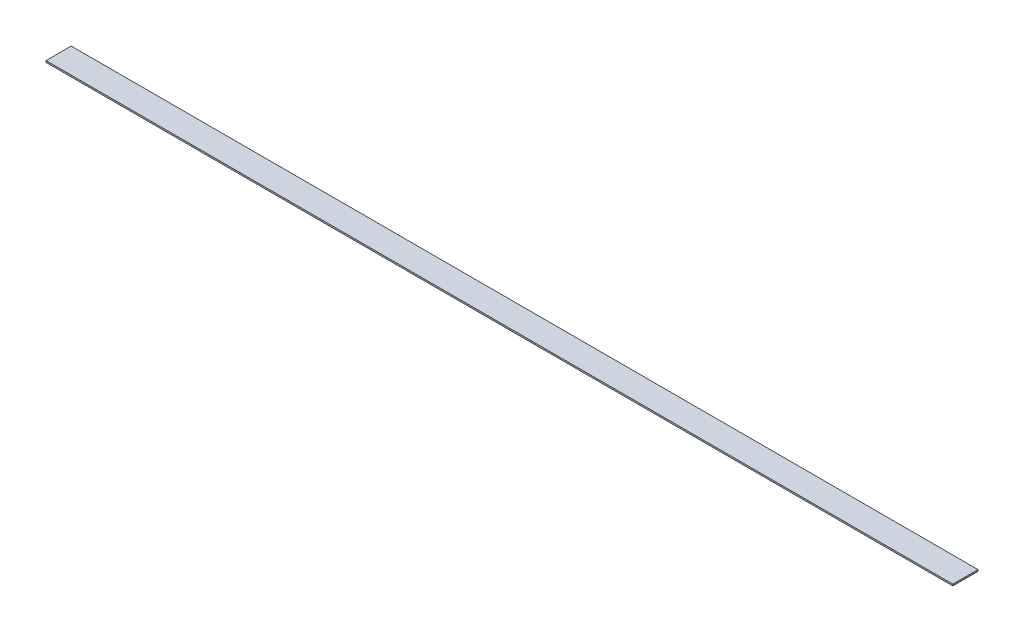
ISO-10303-21;
HEADER;
FILE_DESCRIPTION(('STEP AP214'),'2;1');
FILE_NAME('part.step','',(''),(''),'','','');
FILE_SCHEMA(('AUTOMOTIVE_DESIGN { 1 0 10303 214 1 1 1 1 }'));
ENDSEC;
DATA;
#1=APPLICATION_CONTEXT('core data for automotive mechanical design processes');
#2=APPLICATION_PROTOCOL_DEFINITION('international standard','automotive_design',2000,#1);
#3=PRODUCT_CONTEXT('',#1,'mechanical');
#4=PRODUCT('Part','Part','',(#3));
#5=PRODUCT_RELATED_PRODUCT_CATEGORY('part','',(#4));
#6=PRODUCT_DEFINITION_FORMATION('','',#4);
#7=PRODUCT_DEFINITION_CONTEXT('part definition',#1,'design');
#8=PRODUCT_DEFINITION('design','',#6,#7);
#9=PRODUCT_DEFINITION_SHAPE('','',#8);
#10=(LENGTH_UNIT() NAMED_UNIT(*) SI_UNIT(.MILLI.,.METRE.));
#11=(NAMED_UNIT(*) PLANE_ANGLE_UNIT() SI_UNIT($,.RADIAN.));
#12=(NAMED_UNIT(*) SI_UNIT($,.STERADIAN.) SOLID_ANGLE_UNIT());
#13=UNCERTAINTY_MEASURE_WITH_UNIT(LENGTH_MEASURE(1.E-05),#10,'distance_accuracy_value','');
#14=(GEOMETRIC_REPRESENTATION_CONTEXT(3) GLOBAL_UNCERTAINTY_ASSIGNED_CONTEXT((#13)) GLOBAL_UNIT_ASSIGNED_CONTEXT((#10,
#11,#12)) REPRESENTATION_CONTEXT('',''));
#15=CARTESIAN_POINT('',(0.,0.,0.));
#16=DIRECTION('',(0.,0.,1.));
#17=DIRECTION('',(1.,0.,0.));
#18=AXIS2_PLACEMENT_3D('',#15,#16,#17);
#19=CARTESIAN_POINT('',(0.,1.5875,0.));
#20=DIRECTION('',(1.,0.,0.));
#21=DIRECTION('',(0.,0.,-1.));
#22=AXIS2_PLACEMENT_3D('',#19,#20,#21);
#23=PLANE('',#22);
#24=DIRECTION('',(0.,0.,1.));
#25=VECTOR('',#24,1.);
#26=CARTESIAN_POINT('',(0.,0.,0.));
#27=LINE('',#26,#25);
#28=CARTESIAN_POINT('',(0.,0.,-25.4));
#29=VERTEX_POINT('',#28);
#30=CARTESIAN_POINT('',(0.,0.,0.));
#31=VERTEX_POINT('',#30);
#32=EDGE_CURVE('E115',#29,#31,#27,.T.);
#33=ORIENTED_EDGE('',*,*,#32,.T.);
#34=DIRECTION('',(0.,-1.,0.));
#35=VECTOR('',#34,1.);
#36=CARTESIAN_POINT('',(0.,1.5875,0.));
#37=LINE('',#36,#35);
#38=CARTESIAN_POINT('',(0.,1.5875,0.));
#39=VERTEX_POINT('',#38);
#40=EDGE_CURVE('E11',#39,#31,#37,.T.);
#41=ORIENTED_EDGE('',*,*,#40,.F.);
#42=DIRECTION('',(0.,0.,1.));
#43=VECTOR('',#42,1.);
#44=CARTESIAN_POINT('',(0.,1.5875,0.));
#45=LINE('',#44,#43);
#46=CARTESIAN_POINT('',(0.,1.5875,-25.4));
#47=VERTEX_POINT('',#46);
#48=EDGE_CURVE('E98',#47,#39,#45,.T.);
#49=ORIENTED_EDGE('',*,*,#48,.F.);
#50=DIRECTION('',(0.,-1.,0.));
#51=VECTOR('',#50,1.);
#52=CARTESIAN_POINT('',(0.,1.5875,-25.4));
#53=LINE('',#52,#51);
#54=EDGE_CURVE('E111',#47,#29,#53,.T.);
#55=ORIENTED_EDGE('',*,*,#54,.T.);
#56=EDGE_LOOP('',(#33,#41,#49,#55));
#57=FACE_BOUND('',#56,.T.);
#58=ADVANCED_FACE('F38',(#57),#23,.F.);
#59=CARTESIAN_POINT('',(0.,1.5875,0.));
#60=DIRECTION('',(0.,0.,-1.));
#61=DIRECTION('',(-1.,0.,0.));
#62=AXIS2_PLACEMENT_3D('',#59,#60,#61);
#63=PLANE('',#62);
#64=DIRECTION('',(1.,0.,0.));
#65=VECTOR('',#64,1.);
#66=CARTESIAN_POINT('',(0.,0.,0.));
#67=LINE('',#66,#65);
#68=CARTESIAN_POINT('',(914.4,0.,0.));
#69=VERTEX_POINT('',#68);
#70=EDGE_CURVE('E103',#31,#69,#67,.T.);
#71=ORIENTED_EDGE('',*,*,#70,.T.);
#72=DIRECTION('',(0.,-1.,0.));
#73=VECTOR('',#72,1.);
#74=CARTESIAN_POINT('',(914.4,1.5875,0.));
#75=LINE('',#74,#73);
#76=CARTESIAN_POINT('',(914.4,1.5875,0.));
#77=VERTEX_POINT('',#76);
#78=EDGE_CURVE('E47',#77,#69,#75,.T.);
#79=ORIENTED_EDGE('',*,*,#78,.F.);
#80=DIRECTION('',(1.,0.,0.));
#81=VECTOR('',#80,1.);
#82=CARTESIAN_POINT('',(0.,1.5875,0.));
#83=LINE('',#82,#81);
#84=EDGE_CURVE('E93',#39,#77,#83,.T.);
#85=ORIENTED_EDGE('',*,*,#84,.F.);
#86=ORIENTED_EDGE('',*,*,#40,.T.);
#87=EDGE_LOOP('',(#71,#79,#85,#86));
#88=FACE_BOUND('',#87,.T.);
#89=ADVANCED_FACE('F102',(#88),#63,.F.);
#90=CARTESIAN_POINT('',(914.4,1.5875,0.));
#91=DIRECTION('',(-1.,0.,0.));
#92=DIRECTION('',(0.,0.,1.));
#93=AXIS2_PLACEMENT_3D('',#90,#91,#92);
#94=PLANE('',#93);
#95=DIRECTION('',(0.,0.,-1.));
#96=VECTOR('',#95,1.);
#97=CARTESIAN_POINT('',(914.4,0.,0.));
#98=LINE('',#97,#96);
#99=CARTESIAN_POINT('',(914.4,0.,-25.4));
#100=VERTEX_POINT('',#99);
#101=EDGE_CURVE('E79',#69,#100,#98,.T.);
#102=ORIENTED_EDGE('',*,*,#101,.T.);
#103=DIRECTION('',(0.,-1.,0.));
#104=VECTOR('',#103,1.);
#105=CARTESIAN_POINT('',(914.4,1.5875,-25.4));
#106=LINE('',#105,#104);
#107=CARTESIAN_POINT('',(914.4,1.5875,-25.4));
#108=VERTEX_POINT('',#107);
#109=EDGE_CURVE('E105',#108,#100,#106,.T.);
#110=ORIENTED_EDGE('',*,*,#109,.F.);
#111=DIRECTION('',(0.,0.,-1.));
#112=VECTOR('',#111,1.);
#113=CARTESIAN_POINT('',(914.4,1.5875,0.));
#114=LINE('',#113,#112);
#115=EDGE_CURVE('E96',#77,#108,#114,.T.);
#116=ORIENTED_EDGE('',*,*,#115,.F.);
#117=ORIENTED_EDGE('',*,*,#78,.T.);
#118=EDGE_LOOP('',(#102,#110,#116,#117));
#119=FACE_BOUND('',#118,.T.);
#120=ADVANCED_FACE('F106',(#119),#94,.F.);
#121=CARTESIAN_POINT('',(0.,1.5875,-25.4));
#122=DIRECTION('',(0.,0.,1.));
#123=DIRECTION('',(1.,0.,0.));
#124=AXIS2_PLACEMENT_3D('',#121,#122,#123);
#125=PLANE('',#124);
#126=DIRECTION('',(-1.,0.,0.));
#127=VECTOR('',#126,1.);
#128=CARTESIAN_POINT('',(0.,0.,-25.4));
#129=LINE('',#128,#127);
#130=EDGE_CURVE('E86',#100,#29,#129,.T.);
#131=ORIENTED_EDGE('',*,*,#130,.T.);
#132=ORIENTED_EDGE('',*,*,#54,.F.);
#133=DIRECTION('',(-1.,0.,0.));
#134=VECTOR('',#133,1.);
#135=CARTESIAN_POINT('',(0.,1.5875,-25.4));
#136=LINE('',#135,#134);
#137=EDGE_CURVE('E57',#108,#47,#136,.T.);
#138=ORIENTED_EDGE('',*,*,#137,.F.);
#139=ORIENTED_EDGE('',*,*,#109,.T.);
#140=EDGE_LOOP('',(#131,#132,#138,#139));
#141=FACE_BOUND('',#140,.T.);
#142=ADVANCED_FACE('F127',(#141),#125,.F.);
#143=CARTESIAN_POINT('',(0.,1.5875,0.));
#144=DIRECTION('',(0.,-1.,0.));
#145=DIRECTION('',(0.,0.,-1.));
#146=AXIS2_PLACEMENT_3D('',#143,#144,#145);
#147=PLANE('',#146);
#148=ORIENTED_EDGE('',*,*,#48,.T.);
#149=ORIENTED_EDGE('',*,*,#84,.T.);
#150=ORIENTED_EDGE('',*,*,#115,.T.);
#151=ORIENTED_EDGE('',*,*,#137,.T.);
#152=EDGE_LOOP('',(#148,#149,#150,#151));
#153=FACE_BOUND('',#152,.T.);
#154=ADVANCED_FACE('F94',(#153),#147,.F.);
#155=CARTESIAN_POINT('',(0.,0.,0.));
#156=DIRECTION('',(0.,-1.,0.));
#157=DIRECTION('',(0.,0.,-1.));
#158=AXIS2_PLACEMENT_3D('',#155,#156,#157);
#159=PLANE('',#158);
#160=ORIENTED_EDGE('',*,*,#32,.F.);
#161=ORIENTED_EDGE('',*,*,#130,.F.);
#162=ORIENTED_EDGE('',*,*,#101,.F.);
#163=ORIENTED_EDGE('',*,*,#70,.F.);
#164=EDGE_LOOP('',(#160,#161,#162,#163));
#165=FACE_BOUND('',#164,.T.);
#166=ADVANCED_FACE('F130',(#165),#159,.T.);
#167=CLOSED_SHELL('',(#58,#89,#120,#142,#154,#166));
#168=MANIFOLD_SOLID_BREP('B2',#167);
#169=ADVANCED_BREP_SHAPE_REPRESENTATION('',(#18,#168),#14);
#170=SHAPE_DEFINITION_REPRESENTATION(#9,#169);
ENDSEC;
END-ISO-10303-21;
